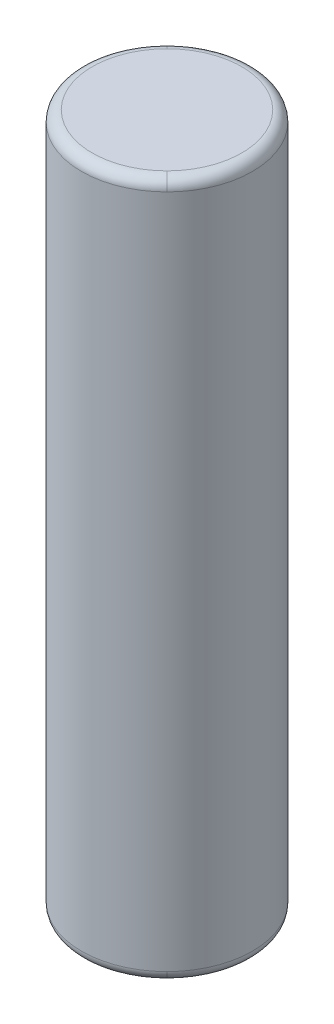
ISO-10303-21;
HEADER;
FILE_DESCRIPTION(('STEP AP214'),'2;1');
FILE_NAME('part.step','',(''),(''),'','','');
FILE_SCHEMA(('AUTOMOTIVE_DESIGN { 1 0 10303 214 1 1 1 1 }'));
ENDSEC;
DATA;
#1=APPLICATION_CONTEXT('core data for automotive mechanical design processes');
#2=APPLICATION_PROTOCOL_DEFINITION('international standard','automotive_design',2000,#1);
#3=PRODUCT_CONTEXT('',#1,'mechanical');
#4=PRODUCT('Part','Part','',(#3));
#5=PRODUCT_RELATED_PRODUCT_CATEGORY('part','',(#4));
#6=PRODUCT_DEFINITION_FORMATION('','',#4);
#7=PRODUCT_DEFINITION_CONTEXT('part definition',#1,'design');
#8=PRODUCT_DEFINITION('design','',#6,#7);
#9=PRODUCT_DEFINITION_SHAPE('','',#8);
#10=(LENGTH_UNIT() NAMED_UNIT(*) SI_UNIT(.MILLI.,.METRE.));
#11=(NAMED_UNIT(*) PLANE_ANGLE_UNIT() SI_UNIT($,.RADIAN.));
#12=(NAMED_UNIT(*) SI_UNIT($,.STERADIAN.) SOLID_ANGLE_UNIT());
#13=UNCERTAINTY_MEASURE_WITH_UNIT(LENGTH_MEASURE(1.E-05),#10,'distance_accuracy_value','');
#14=(GEOMETRIC_REPRESENTATION_CONTEXT(3) GLOBAL_UNCERTAINTY_ASSIGNED_CONTEXT((#13)) GLOBAL_UNIT_ASSIGNED_CONTEXT((#10,
#11,#12)) REPRESENTATION_CONTEXT('',''));
#15=CARTESIAN_POINT('',(0.,0.,0.));
#16=DIRECTION('',(0.,0.,1.));
#17=DIRECTION('',(1.,0.,0.));
#18=AXIS2_PLACEMENT_3D('',#15,#16,#17);
#19=CARTESIAN_POINT('',(16.4622826667123,-3.97409052550787,8.32430580273434));
#20=DIRECTION('',(0.,-1.,0.));
#21=DIRECTION('',(-0.707106781186548,0.,-0.707106781186547));
#22=AXIS2_PLACEMENT_3D('',#19,#20,#21);
#23=TOROIDAL_SURFACE('',#22,1.75,0.25);
#24=CARTESIAN_POINT('',(17.6997195337888,-3.97409052550787,9.5617426698108));
#25=DIRECTION('',(0.707106781186548,0.,-0.707106781186548));
#26=DIRECTION('',(-0.707106781186548,0.,-0.707106781186548));
#27=AXIS2_PLACEMENT_3D('',#24,#25,#26);
#28=CIRCLE('',#27,0.25);
#29=CARTESIAN_POINT('',(17.6997195337888,-3.72409052550787,9.5617426698108));
#30=VERTEX_POINT('',#29);
#31=CARTESIAN_POINT('',(17.8764962290854,-3.97409052550787,9.73851936510743));
#32=VERTEX_POINT('',#31);
#33=EDGE_CURVE('E110',#30,#32,#28,.T.);
#34=ORIENTED_EDGE('',*,*,#33,.F.);
#35=CARTESIAN_POINT('',(16.4622826667123,-3.72409052550787,8.32430580273434));
#36=DIRECTION('',(0.,-1.,0.));
#37=DIRECTION('',(0.707106781186547,0.,-0.707106781186548));
#38=AXIS2_PLACEMENT_3D('',#35,#36,#37);
#39=CIRCLE('',#38,1.75);
#40=CARTESIAN_POINT('',(15.2248457996358,-3.72409052550787,7.08686893565788));
#41=VERTEX_POINT('',#40);
#42=EDGE_CURVE('E28',#30,#41,#39,.T.);
#43=ORIENTED_EDGE('',*,*,#42,.T.);
#44=CARTESIAN_POINT('',(15.2248457996358,-3.97409052550787,7.08686893565788));
#45=DIRECTION('',(-0.707106781186549,0.,0.707106781186546));
#46=DIRECTION('',(0.707106781186546,0.,0.707106781186549));
#47=AXIS2_PLACEMENT_3D('',#44,#45,#46);
#48=CIRCLE('',#47,0.25);
#49=CARTESIAN_POINT('',(15.0480691043392,-3.97409052550787,6.91009224036124));
#50=VERTEX_POINT('',#49);
#51=EDGE_CURVE('E118',#41,#50,#48,.T.);
#52=ORIENTED_EDGE('',*,*,#51,.T.);
#53=CARTESIAN_POINT('',(16.4622826667123,-3.97409052550787,8.32430580273434));
#54=DIRECTION('',(0.,1.,0.));
#55=DIRECTION('',(0.707106781186547,0.,-0.707106781186548));
#56=AXIS2_PLACEMENT_3D('',#53,#54,#55);
#57=CIRCLE('',#56,2.);
#58=CARTESIAN_POINT('',(15.0480691043392,-3.97409052550787,9.73851936510743));
#59=VERTEX_POINT('',#58);
#60=EDGE_CURVE('E150',#50,#59,#57,.T.);
#61=ORIENTED_EDGE('',*,*,#60,.T.);
#62=CARTESIAN_POINT('',(16.4622826667123,-3.97409052550787,8.32430580273434));
#63=DIRECTION('',(0.,1.,0.));
#64=DIRECTION('',(0.707106781186547,0.,-0.707106781186548));
#65=AXIS2_PLACEMENT_3D('',#62,#63,#64);
#66=CIRCLE('',#65,2.);
#67=EDGE_CURVE('E11',#59,#32,#66,.T.);
#68=ORIENTED_EDGE('',*,*,#67,.T.);
#69=EDGE_LOOP('',(#34,#43,#52,#61,#68));
#70=FACE_BOUND('',#69,.T.);
#71=ADVANCED_FACE('F17',(#70),#23,.T.);
#72=CARTESIAN_POINT('',(16.4622826667123,-21.020500867386,8.32430580273434));
#73=DIRECTION('',(0.,1.,0.));
#74=DIRECTION('',(0.707106781186547,0.,-0.707106781186548));
#75=AXIS2_PLACEMENT_3D('',#72,#73,#74);
#76=CYLINDRICAL_SURFACE('',#75,2.);
#77=DIRECTION('',(0.,1.,0.));
#78=VECTOR('',#77,1.);
#79=CARTESIAN_POINT('',(15.0480691043392,-21.020500867386,9.73851936510744));
#80=LINE('',#79,#78);
#81=CARTESIAN_POINT('',(15.0480691043392,-19.7740909362223,9.73851936510743));
#82=VERTEX_POINT('',#81);
#83=EDGE_CURVE('E144',#82,#59,#80,.T.);
#84=ORIENTED_EDGE('',*,*,#83,.F.);
#85=CARTESIAN_POINT('',(16.4622826667123,-19.7740909362223,8.32430580273434));
#86=DIRECTION('',(0.,-1.,0.));
#87=DIRECTION('',(-0.707106781186547,0.,0.707106781186548));
#88=AXIS2_PLACEMENT_3D('',#85,#86,#87);
#89=CIRCLE('',#88,2.);
#90=CARTESIAN_POINT('',(17.8764962290854,-19.7740909362223,9.73851936510743));
#91=VERTEX_POINT('',#90);
#92=EDGE_CURVE('E63',#91,#82,#89,.T.);
#93=ORIENTED_EDGE('',*,*,#92,.F.);
#94=CARTESIAN_POINT('',(16.4622826667123,-19.7740909362223,8.32430580273434));
#95=DIRECTION('',(0.,-1.,0.));
#96=DIRECTION('',(-0.707106781186547,0.,0.707106781186548));
#97=AXIS2_PLACEMENT_3D('',#94,#95,#96);
#98=CIRCLE('',#97,2.);
#99=CARTESIAN_POINT('',(17.8764962290854,-19.7740909362223,6.91009224036124));
#100=VERTEX_POINT('',#99);
#101=EDGE_CURVE('E74',#100,#91,#98,.T.);
#102=ORIENTED_EDGE('',*,*,#101,.F.);
#103=DIRECTION('',(0.,1.,0.));
#104=VECTOR('',#103,1.);
#105=CARTESIAN_POINT('',(17.8764962290854,-21.020500867386,6.91009224036124));
#106=LINE('',#105,#104);
#107=CARTESIAN_POINT('',(17.8764962290854,-3.97409052550787,6.91009224036124));
#108=VERTEX_POINT('',#107);
#109=EDGE_CURVE('E155',#100,#108,#106,.T.);
#110=ORIENTED_EDGE('',*,*,#109,.T.);
#111=CARTESIAN_POINT('',(16.4622826667123,-3.97409052550787,8.32430580273434));
#112=DIRECTION('',(0.,1.,0.));
#113=DIRECTION('',(0.707106781186547,0.,-0.707106781186548));
#114=AXIS2_PLACEMENT_3D('',#111,#112,#113);
#115=CIRCLE('',#114,2.);
#116=EDGE_CURVE('E114',#32,#108,#115,.T.);
#117=ORIENTED_EDGE('',*,*,#116,.F.);
#118=ORIENTED_EDGE('',*,*,#67,.F.);
#119=EDGE_LOOP('',(#84,#93,#102,#110,#117,#118));
#120=FACE_BOUND('',#119,.T.);
#121=ADVANCED_FACE('F173',(#120),#76,.T.);
#122=CARTESIAN_POINT('',(11.3534361726395,-3.72409052550787,13.4331522968071));
#123=DIRECTION('',(0.,-1.,0.));
#124=DIRECTION('',(-1.,0.,0.));
#125=AXIS2_PLACEMENT_3D('',#122,#123,#124);
#126=PLANE('',#125);
#127=CARTESIAN_POINT('',(16.4622826667123,-3.72409052550787,8.32430580273434));
#128=DIRECTION('',(0.,-1.,0.));
#129=DIRECTION('',(0.707106781186547,0.,-0.707106781186548));
#130=AXIS2_PLACEMENT_3D('',#127,#128,#129);
#131=CIRCLE('',#130,1.75);
#132=EDGE_CURVE('E104',#41,#30,#131,.T.);
#133=ORIENTED_EDGE('',*,*,#132,.F.);
#134=ORIENTED_EDGE('',*,*,#42,.F.);
#135=EDGE_LOOP('',(#133,#134));
#136=FACE_BOUND('',#135,.T.);
#137=ADVANCED_FACE('F102',(#136),#126,.F.);
#138=CARTESIAN_POINT('',(16.4622826667123,-19.7740909362223,8.32430580273434));
#139=DIRECTION('',(0.,-1.,0.));
#140=DIRECTION('',(-0.707106781186548,0.,-0.707106781186547));
#141=AXIS2_PLACEMENT_3D('',#138,#139,#140);
#142=TOROIDAL_SURFACE('',#141,1.75,0.25);
#143=CARTESIAN_POINT('',(17.6997195337888,-19.7740909362223,9.5617426698108));
#144=DIRECTION('',(0.707106781186548,0.,-0.707106781186548));
#145=DIRECTION('',(-0.707106781186548,0.,-0.707106781186548));
#146=AXIS2_PLACEMENT_3D('',#143,#144,#145);
#147=CIRCLE('',#146,0.25);
#148=CARTESIAN_POINT('',(17.6997195337888,-20.0240909362223,9.5617426698108));
#149=VERTEX_POINT('',#148);
#150=EDGE_CURVE('E125',#91,#149,#147,.T.);
#151=ORIENTED_EDGE('',*,*,#150,.F.);
#152=ORIENTED_EDGE('',*,*,#92,.T.);
#153=CARTESIAN_POINT('',(16.4622826667123,-19.7740909362223,8.32430580273434));
#154=DIRECTION('',(0.,-1.,0.));
#155=DIRECTION('',(-0.707106781186547,0.,0.707106781186548));
#156=AXIS2_PLACEMENT_3D('',#153,#154,#155);
#157=CIRCLE('',#156,2.);
#158=CARTESIAN_POINT('',(15.0480691043392,-19.7740909362223,6.91009224036124));
#159=VERTEX_POINT('',#158);
#160=EDGE_CURVE('E138',#82,#159,#157,.T.);
#161=ORIENTED_EDGE('',*,*,#160,.T.);
#162=CARTESIAN_POINT('',(15.2248457996358,-19.7740909362223,7.08686893565788));
#163=DIRECTION('',(-0.707106781186549,0.,0.707106781186546));
#164=DIRECTION('',(0.707106781186546,0.,0.707106781186549));
#165=AXIS2_PLACEMENT_3D('',#162,#163,#164);
#166=CIRCLE('',#165,0.25);
#167=CARTESIAN_POINT('',(15.2248457996358,-20.0240909362223,7.08686893565788));
#168=VERTEX_POINT('',#167);
#169=EDGE_CURVE('E132',#159,#168,#166,.T.);
#170=ORIENTED_EDGE('',*,*,#169,.T.);
#171=CARTESIAN_POINT('',(16.4622826667123,-20.0240909362223,8.32430580273434));
#172=DIRECTION('',(0.,1.,0.));
#173=DIRECTION('',(-0.707106781186547,0.,0.707106781186548));
#174=AXIS2_PLACEMENT_3D('',#171,#172,#173);
#175=CIRCLE('',#174,1.75);
#176=EDGE_CURVE('E42',#168,#149,#175,.T.);
#177=ORIENTED_EDGE('',*,*,#176,.T.);
#178=EDGE_LOOP('',(#151,#152,#161,#170,#177));
#179=FACE_BOUND('',#178,.T.);
#180=ADVANCED_FACE('F175',(#179),#142,.T.);
#181=CARTESIAN_POINT('',(11.3534361726395,-20.0240909362223,13.4331522968071));
#182=DIRECTION('',(0.,-1.,0.));
#183=DIRECTION('',(-1.,0.,0.));
#184=AXIS2_PLACEMENT_3D('',#181,#182,#183);
#185=PLANE('',#184);
#186=ORIENTED_EDGE('',*,*,#176,.F.);
#187=CARTESIAN_POINT('',(16.4622826667123,-20.0240909362223,8.32430580273434));
#188=DIRECTION('',(0.,1.,0.));
#189=DIRECTION('',(-0.707106781186547,0.,0.707106781186548));
#190=AXIS2_PLACEMENT_3D('',#187,#188,#189);
#191=CIRCLE('',#190,1.75);
#192=EDGE_CURVE('E128',#149,#168,#191,.T.);
#193=ORIENTED_EDGE('',*,*,#192,.F.);
#194=EDGE_LOOP('',(#186,#193));
#195=FACE_BOUND('',#194,.T.);
#196=ADVANCED_FACE('F176',(#195),#185,.T.);
#197=CARTESIAN_POINT('',(16.4622826667123,-19.7740909362223,8.32430580273434));
#198=DIRECTION('',(0.,-1.,0.));
#199=DIRECTION('',(-0.707106781186548,0.,-0.707106781186547));
#200=AXIS2_PLACEMENT_3D('',#197,#198,#199);
#201=TOROIDAL_SURFACE('',#200,1.75,0.25);
#202=CARTESIAN_POINT('',(16.4622826667123,-19.7740909362223,8.32430580273434));
#203=DIRECTION('',(0.,-1.,0.));
#204=DIRECTION('',(-0.707106781186547,0.,0.707106781186548));
#205=AXIS2_PLACEMENT_3D('',#202,#203,#204);
#206=CIRCLE('',#205,2.);
#207=EDGE_CURVE('E21',#159,#100,#206,.T.);
#208=ORIENTED_EDGE('',*,*,#207,.T.);
#209=ORIENTED_EDGE('',*,*,#101,.T.);
#210=ORIENTED_EDGE('',*,*,#150,.T.);
#211=ORIENTED_EDGE('',*,*,#192,.T.);
#212=ORIENTED_EDGE('',*,*,#169,.F.);
#213=EDGE_LOOP('',(#208,#209,#210,#211,#212));
#214=FACE_BOUND('',#213,.T.);
#215=ADVANCED_FACE('F19',(#214),#201,.T.);
#216=CARTESIAN_POINT('',(16.4622826667123,-21.020500867386,8.32430580273434));
#217=DIRECTION('',(0.,1.,0.));
#218=DIRECTION('',(0.707106781186547,0.,-0.707106781186548));
#219=AXIS2_PLACEMENT_3D('',#216,#217,#218);
#220=CYLINDRICAL_SURFACE('',#219,2.);
#221=ORIENTED_EDGE('',*,*,#160,.F.);
#222=ORIENTED_EDGE('',*,*,#83,.T.);
#223=ORIENTED_EDGE('',*,*,#60,.F.);
#224=CARTESIAN_POINT('',(16.4622826667123,-3.97409052550787,8.32430580273434));
#225=DIRECTION('',(0.,1.,0.));
#226=DIRECTION('',(0.707106781186547,0.,-0.707106781186548));
#227=AXIS2_PLACEMENT_3D('',#224,#225,#226);
#228=CIRCLE('',#227,2.);
#229=EDGE_CURVE('E133',#108,#50,#228,.T.);
#230=ORIENTED_EDGE('',*,*,#229,.F.);
#231=ORIENTED_EDGE('',*,*,#109,.F.);
#232=ORIENTED_EDGE('',*,*,#207,.F.);
#233=EDGE_LOOP('',(#221,#222,#223,#230,#231,#232));
#234=FACE_BOUND('',#233,.T.);
#235=ADVANCED_FACE('F172',(#234),#220,.T.);
#236=CARTESIAN_POINT('',(16.4622826667123,-3.97409052550787,8.32430580273434));
#237=DIRECTION('',(0.,-1.,0.));
#238=DIRECTION('',(-0.707106781186548,0.,-0.707106781186547));
#239=AXIS2_PLACEMENT_3D('',#236,#237,#238);
#240=TOROIDAL_SURFACE('',#239,1.75,0.25);
#241=ORIENTED_EDGE('',*,*,#132,.T.);
#242=ORIENTED_EDGE('',*,*,#33,.T.);
#243=ORIENTED_EDGE('',*,*,#116,.T.);
#244=ORIENTED_EDGE('',*,*,#229,.T.);
#245=ORIENTED_EDGE('',*,*,#51,.F.);
#246=EDGE_LOOP('',(#241,#242,#243,#244,#245));
#247=FACE_BOUND('',#246,.T.);
#248=ADVANCED_FACE('F116',(#247),#240,.T.);
#249=CLOSED_SHELL('',(#71,#121,#137,#180,#196,#215,#235,#248));
#250=MANIFOLD_SOLID_BREP('B1',#249);
#251=ADVANCED_BREP_SHAPE_REPRESENTATION('',(#18,#250),#14);
#252=SHAPE_DEFINITION_REPRESENTATION(#9,#251);
ENDSEC;
END-ISO-10303-21;
